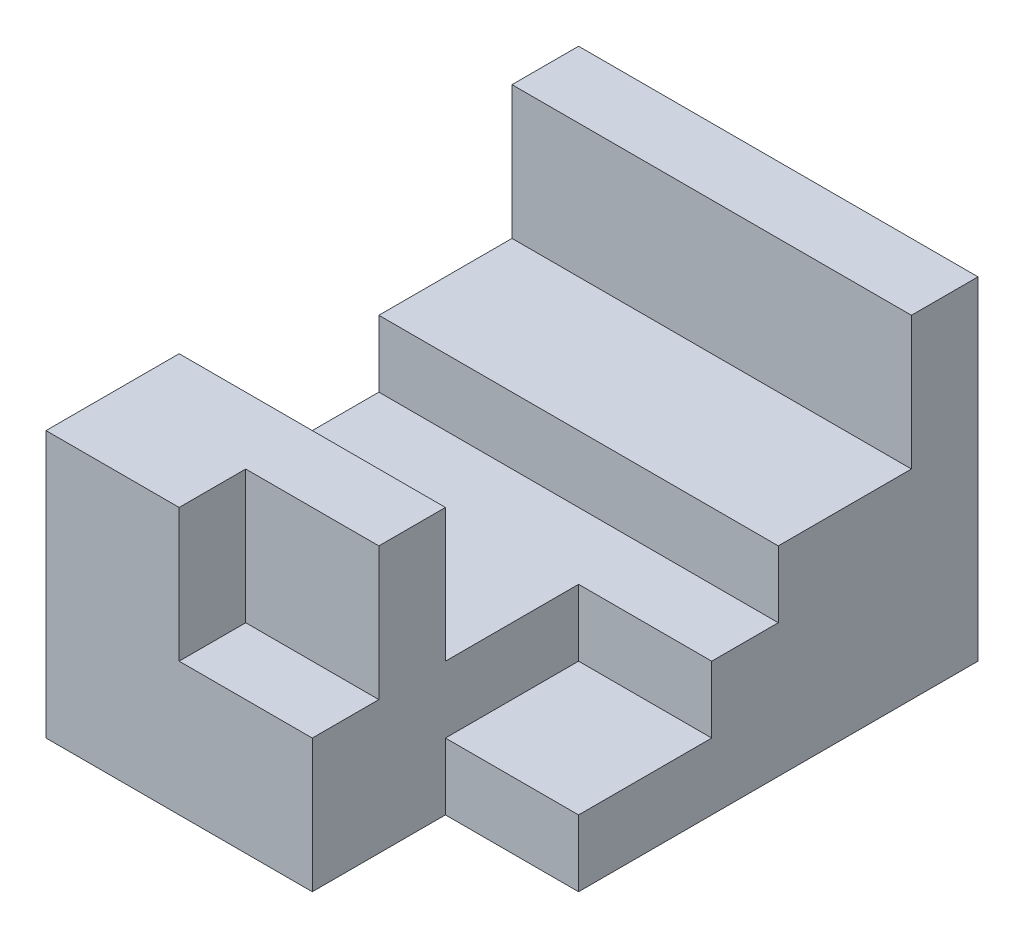
ISO-10303-21;
HEADER;
FILE_DESCRIPTION(('STEP AP214'),'2;1');
FILE_NAME('part.step','',(''),(''),'','','');
FILE_SCHEMA(('AUTOMOTIVE_DESIGN { 1 0 10303 214 1 1 1 1 }'));
ENDSEC;
DATA;
#1=APPLICATION_CONTEXT('core data for automotive mechanical design processes');
#2=APPLICATION_PROTOCOL_DEFINITION('international standard','automotive_design',2000,#1);
#3=PRODUCT_CONTEXT('',#1,'mechanical');
#4=PRODUCT('Part','Part','',(#3));
#5=PRODUCT_RELATED_PRODUCT_CATEGORY('part','',(#4));
#6=PRODUCT_DEFINITION_FORMATION('','',#4);
#7=PRODUCT_DEFINITION_CONTEXT('part definition',#1,'design');
#8=PRODUCT_DEFINITION('design','',#6,#7);
#9=PRODUCT_DEFINITION_SHAPE('','',#8);
#10=(LENGTH_UNIT() NAMED_UNIT(*) SI_UNIT(.MILLI.,.METRE.));
#11=(NAMED_UNIT(*) PLANE_ANGLE_UNIT() SI_UNIT($,.RADIAN.));
#12=(NAMED_UNIT(*) SI_UNIT($,.STERADIAN.) SOLID_ANGLE_UNIT());
#13=UNCERTAINTY_MEASURE_WITH_UNIT(LENGTH_MEASURE(1.E-05),#10,'distance_accuracy_value','');
#14=(GEOMETRIC_REPRESENTATION_CONTEXT(3) GLOBAL_UNCERTAINTY_ASSIGNED_CONTEXT((#13)) GLOBAL_UNIT_ASSIGNED_CONTEXT((#10,
#11,#12)) REPRESENTATION_CONTEXT('',''));
#15=CARTESIAN_POINT('',(0.,0.,0.));
#16=DIRECTION('',(0.,0.,1.));
#17=DIRECTION('',(1.,0.,0.));
#18=AXIS2_PLACEMENT_3D('',#15,#16,#17);
#19=CARTESIAN_POINT('',(-3.,-2.5,8.));
#20=DIRECTION('',(1.,0.,0.));
#21=DIRECTION('',(0.,0.,-1.));
#22=AXIS2_PLACEMENT_3D('',#19,#20,#21);
#23=PLANE('',#22);
#24=DIRECTION('',(0.,0.,1.));
#25=VECTOR('',#24,1.);
#26=CARTESIAN_POINT('',(-3.,1.5,8.));
#27=LINE('',#26,#25);
#28=CARTESIAN_POINT('',(-3.,1.5,6.));
#29=VERTEX_POINT('',#28);
#30=CARTESIAN_POINT('',(-3.,1.5,8.));
#31=VERTEX_POINT('',#30);
#32=EDGE_CURVE('E183',#29,#31,#27,.T.);
#33=ORIENTED_EDGE('',*,*,#32,.F.);
#34=DIRECTION('',(0.,1.,0.));
#35=VECTOR('',#34,1.);
#36=CARTESIAN_POINT('',(-3.,0.499999999999999,6.));
#37=LINE('',#36,#35);
#38=CARTESIAN_POINT('',(-3.,-0.500000000000001,6.));
#39=VERTEX_POINT('',#38);
#40=EDGE_CURVE('E163',#39,#29,#37,.T.);
#41=ORIENTED_EDGE('',*,*,#40,.F.);
#42=DIRECTION('',(0.,0.,1.));
#43=VECTOR('',#42,1.);
#44=CARTESIAN_POINT('',(-3.,-0.500000000000001,3.));
#45=LINE('',#44,#43);
#46=CARTESIAN_POINT('',(-3.,-0.500000000000001,3.));
#47=VERTEX_POINT('',#46);
#48=EDGE_CURVE('E200',#47,#39,#45,.T.);
#49=ORIENTED_EDGE('',*,*,#48,.F.);
#50=DIRECTION('',(0.,1.,0.));
#51=VECTOR('',#50,1.);
#52=CARTESIAN_POINT('',(-3.,-0.500000000000001,3.));
#53=LINE('',#52,#51);
#54=CARTESIAN_POINT('',(-3.,0.499999999999999,3.));
#55=VERTEX_POINT('',#54);
#56=EDGE_CURVE('E208',#47,#55,#53,.T.);
#57=ORIENTED_EDGE('',*,*,#56,.T.);
#58=DIRECTION('',(0.,0.,1.));
#59=VECTOR('',#58,1.);
#60=CARTESIAN_POINT('',(-3.,0.499999999999999,1.));
#61=LINE('',#60,#59);
#62=CARTESIAN_POINT('',(-3.,0.499999999999999,1.));
#63=VERTEX_POINT('',#62);
#64=EDGE_CURVE('E234',#63,#55,#61,.T.);
#65=ORIENTED_EDGE('',*,*,#64,.F.);
#66=DIRECTION('',(0.,1.,0.));
#67=VECTOR('',#66,1.);
#68=CARTESIAN_POINT('',(-3.,0.499999999999999,1.));
#69=LINE('',#68,#67);
#70=CARTESIAN_POINT('',(-3.,2.5,1.));
#71=VERTEX_POINT('',#70);
#72=EDGE_CURVE('E241',#63,#71,#69,.T.);
#73=ORIENTED_EDGE('',*,*,#72,.T.);
#74=DIRECTION('',(0.,0.,-1.));
#75=VECTOR('',#74,1.);
#76=CARTESIAN_POINT('',(-3.,2.5,8.));
#77=LINE('',#76,#75);
#78=CARTESIAN_POINT('',(-3.,2.5,0.));
#79=VERTEX_POINT('',#78);
#80=EDGE_CURVE('E267',#71,#79,#77,.T.);
#81=ORIENTED_EDGE('',*,*,#80,.T.);
#82=DIRECTION('',(0.,-1.,0.));
#83=VECTOR('',#82,1.);
#84=CARTESIAN_POINT('',(-3.,-2.5,0.));
#85=LINE('',#84,#83);
#86=CARTESIAN_POINT('',(-3.,-2.5,0.));
#87=VERTEX_POINT('',#86);
#88=EDGE_CURVE('E261',#79,#87,#85,.T.);
#89=ORIENTED_EDGE('',*,*,#88,.T.);
#90=DIRECTION('',(0.,0.,-1.));
#91=VECTOR('',#90,1.);
#92=CARTESIAN_POINT('',(-3.,-2.5,8.));
#93=LINE('',#92,#91);
#94=CARTESIAN_POINT('',(-3.,-2.5,8.));
#95=VERTEX_POINT('',#94);
#96=EDGE_CURVE('E40',#95,#87,#93,.T.);
#97=ORIENTED_EDGE('',*,*,#96,.F.);
#98=DIRECTION('',(0.,-1.,0.));
#99=VECTOR('',#98,1.);
#100=CARTESIAN_POINT('',(-3.,-2.5,8.));
#101=LINE('',#100,#99);
#102=EDGE_CURVE('E262',#31,#95,#101,.T.);
#103=ORIENTED_EDGE('',*,*,#102,.F.);
#104=EDGE_LOOP('',(#33,#41,#49,#57,#65,#73,#81,#89,#97,#103));
#105=FACE_BOUND('',#104,.T.);
#106=ADVANCED_FACE('F33',(#105),#23,.F.);
#107=CARTESIAN_POINT('',(0.,0.,8.));
#108=DIRECTION('',(0.,0.,1.));
#109=DIRECTION('',(1.,0.,0.));
#110=AXIS2_PLACEMENT_3D('',#107,#108,#109);
#111=PLANE('',#110);
#112=DIRECTION('',(1.,0.,0.));
#113=VECTOR('',#112,1.);
#114=CARTESIAN_POINT('',(-1.,-0.500000000000001,8.));
#115=LINE('',#114,#113);
#116=CARTESIAN_POINT('',(-1.,-0.500000000000001,8.));
#117=VERTEX_POINT('',#116);
#118=CARTESIAN_POINT('',(1.,-0.500000000000001,8.));
#119=VERTEX_POINT('',#118);
#120=EDGE_CURVE('E168',#117,#119,#115,.T.);
#121=ORIENTED_EDGE('',*,*,#120,.F.);
#122=DIRECTION('',(0.,-1.,0.));
#123=VECTOR('',#122,1.);
#124=CARTESIAN_POINT('',(-1.,2.5,8.));
#125=LINE('',#124,#123);
#126=CARTESIAN_POINT('',(-1.,1.5,8.));
#127=VERTEX_POINT('',#126);
#128=EDGE_CURVE('E152',#127,#117,#125,.T.);
#129=ORIENTED_EDGE('',*,*,#128,.F.);
#130=DIRECTION('',(-1.,0.,0.));
#131=VECTOR('',#130,1.);
#132=CARTESIAN_POINT('',(0.,1.5,8.));
#133=LINE('',#132,#131);
#134=EDGE_CURVE('E189',#127,#31,#133,.T.);
#135=ORIENTED_EDGE('',*,*,#134,.T.);
#136=ORIENTED_EDGE('',*,*,#102,.T.);
#137=DIRECTION('',(1.,0.,0.));
#138=VECTOR('',#137,1.);
#139=CARTESIAN_POINT('',(3.,-2.5,8.));
#140=LINE('',#139,#138);
#141=CARTESIAN_POINT('',(1.,-2.5,8.));
#142=VERTEX_POINT('',#141);
#143=EDGE_CURVE('E264',#95,#142,#140,.T.);
#144=ORIENTED_EDGE('',*,*,#143,.T.);
#145=DIRECTION('',(0.,-1.,0.));
#146=VECTOR('',#145,1.);
#147=CARTESIAN_POINT('',(1.,-2.5,8.));
#148=LINE('',#147,#146);
#149=EDGE_CURVE('E176',#119,#142,#148,.T.);
#150=ORIENTED_EDGE('',*,*,#149,.F.);
#151=EDGE_LOOP('',(#121,#129,#135,#136,#144,#150));
#152=FACE_BOUND('',#151,.T.);
#153=ADVANCED_FACE('F174',(#152),#111,.T.);
#154=CARTESIAN_POINT('',(1.,-2.5,6.));
#155=DIRECTION('',(-1.,0.,0.));
#156=DIRECTION('',(0.,0.,1.));
#157=AXIS2_PLACEMENT_3D('',#154,#155,#156);
#158=PLANE('',#157);
#159=DIRECTION('',(0.,1.,0.));
#160=VECTOR('',#159,1.);
#161=CARTESIAN_POINT('',(1.,2.5,7.));
#162=LINE('',#161,#160);
#163=CARTESIAN_POINT('',(1.,-0.500000000000001,7.));
#164=VERTEX_POINT('',#163);
#165=CARTESIAN_POINT('',(1.,1.5,7.));
#166=VERTEX_POINT('',#165);
#167=EDGE_CURVE('E162',#164,#166,#162,.T.);
#168=ORIENTED_EDGE('',*,*,#167,.F.);
#169=DIRECTION('',(0.,0.,-1.));
#170=VECTOR('',#169,1.);
#171=CARTESIAN_POINT('',(1.,-0.500000000000001,7.));
#172=LINE('',#171,#170);
#173=EDGE_CURVE('E177',#119,#164,#172,.T.);
#174=ORIENTED_EDGE('',*,*,#173,.F.);
#175=ORIENTED_EDGE('',*,*,#149,.T.);
#176=DIRECTION('',(0.,0.,1.));
#177=VECTOR('',#176,1.);
#178=CARTESIAN_POINT('',(1.,-2.5,6.));
#179=LINE('',#178,#177);
#180=CARTESIAN_POINT('',(1.,-2.5,6.));
#181=VERTEX_POINT('',#180);
#182=EDGE_CURVE('E257',#181,#142,#179,.T.);
#183=ORIENTED_EDGE('',*,*,#182,.F.);
#184=DIRECTION('',(0.,-1.,0.));
#185=VECTOR('',#184,1.);
#186=CARTESIAN_POINT('',(1.,-2.5,6.));
#187=LINE('',#186,#185);
#188=CARTESIAN_POINT('',(1.,-1.5,6.));
#189=VERTEX_POINT('',#188);
#190=EDGE_CURVE('E252',#189,#181,#187,.T.);
#191=ORIENTED_EDGE('',*,*,#190,.F.);
#192=DIRECTION('',(0.,0.,1.));
#193=VECTOR('',#192,1.);
#194=CARTESIAN_POINT('',(1.,-1.5,4.));
#195=LINE('',#194,#193);
#196=CARTESIAN_POINT('',(1.,-1.5,4.));
#197=VERTEX_POINT('',#196);
#198=EDGE_CURVE('E220',#197,#189,#195,.T.);
#199=ORIENTED_EDGE('',*,*,#198,.F.);
#200=DIRECTION('',(0.,1.,0.));
#201=VECTOR('',#200,1.);
#202=CARTESIAN_POINT('',(1.,-1.5,4.));
#203=LINE('',#202,#201);
#204=CARTESIAN_POINT('',(1.,-0.5,4.));
#205=VERTEX_POINT('',#204);
#206=EDGE_CURVE('E223',#197,#205,#203,.T.);
#207=ORIENTED_EDGE('',*,*,#206,.T.);
#208=DIRECTION('',(0.,0.,-1.));
#209=VECTOR('',#208,1.);
#210=CARTESIAN_POINT('',(1.,-0.5,6.));
#211=LINE('',#210,#209);
#212=CARTESIAN_POINT('',(1.,-0.5,6.));
#213=VERTEX_POINT('',#212);
#214=EDGE_CURVE('E54',#213,#205,#211,.T.);
#215=ORIENTED_EDGE('',*,*,#214,.F.);
#216=CARTESIAN_POINT('',(1.,1.5,6.));
#217=VERTEX_POINT('',#216);
#218=EDGE_CURVE('E253',#217,#213,#187,.T.);
#219=ORIENTED_EDGE('',*,*,#218,.F.);
#220=DIRECTION('',(0.,0.,-1.));
#221=VECTOR('',#220,1.);
#222=CARTESIAN_POINT('',(1.,1.5,6.));
#223=LINE('',#222,#221);
#224=EDGE_CURVE('E46',#166,#217,#223,.T.);
#225=ORIENTED_EDGE('',*,*,#224,.F.);
#226=EDGE_LOOP('',(#168,#174,#175,#183,#191,#199,#207,#215,#219,#225));
#227=FACE_BOUND('',#226,.T.);
#228=ADVANCED_FACE('F312',(#227),#158,.F.);
#229=CARTESIAN_POINT('',(-1.,2.5,7.));
#230=DIRECTION('',(-1.,0.,0.));
#231=DIRECTION('',(0.,-1.,0.));
#232=AXIS2_PLACEMENT_3D('',#229,#230,#231);
#233=PLANE('',#232);
#234=DIRECTION('',(0.,0.,-1.));
#235=VECTOR('',#234,1.);
#236=CARTESIAN_POINT('',(-1.,1.5,7.));
#237=LINE('',#236,#235);
#238=CARTESIAN_POINT('',(-1.,1.5,7.));
#239=VERTEX_POINT('',#238);
#240=EDGE_CURVE('E158',#127,#239,#237,.T.);
#241=ORIENTED_EDGE('',*,*,#240,.F.);
#242=ORIENTED_EDGE('',*,*,#128,.T.);
#243=DIRECTION('',(0.,0.,1.));
#244=VECTOR('',#243,1.);
#245=CARTESIAN_POINT('',(-1.,-0.500000000000001,7.));
#246=LINE('',#245,#244);
#247=CARTESIAN_POINT('',(-1.,-0.500000000000001,7.));
#248=VERTEX_POINT('',#247);
#249=EDGE_CURVE('E156',#248,#117,#246,.T.);
#250=ORIENTED_EDGE('',*,*,#249,.F.);
#251=DIRECTION('',(0.,-1.,0.));
#252=VECTOR('',#251,1.);
#253=CARTESIAN_POINT('',(-1.,2.5,7.));
#254=LINE('',#253,#252);
#255=EDGE_CURVE('E247',#239,#248,#254,.T.);
#256=ORIENTED_EDGE('',*,*,#255,.F.);
#257=EDGE_LOOP('',(#241,#242,#250,#256));
#258=FACE_BOUND('',#257,.T.);
#259=ADVANCED_FACE('F154',(#258),#233,.F.);
#260=CARTESIAN_POINT('',(0.,0.,7.));
#261=DIRECTION('',(0.,0.,1.));
#262=DIRECTION('',(1.,0.,0.));
#263=AXIS2_PLACEMENT_3D('',#260,#261,#262);
#264=PLANE('',#263);
#265=ORIENTED_EDGE('',*,*,#167,.T.);
#266=DIRECTION('',(-1.,0.,0.));
#267=VECTOR('',#266,1.);
#268=CARTESIAN_POINT('',(0.,1.5,7.));
#269=LINE('',#268,#267);
#270=EDGE_CURVE('E185',#166,#239,#269,.T.);
#271=ORIENTED_EDGE('',*,*,#270,.T.);
#272=ORIENTED_EDGE('',*,*,#255,.T.);
#273=DIRECTION('',(-1.,0.,0.));
#274=VECTOR('',#273,1.);
#275=CARTESIAN_POINT('',(-1.,-0.500000000000001,7.));
#276=LINE('',#275,#274);
#277=EDGE_CURVE('E171',#164,#248,#276,.T.);
#278=ORIENTED_EDGE('',*,*,#277,.F.);
#279=EDGE_LOOP('',(#265,#271,#272,#278));
#280=FACE_BOUND('',#279,.T.);
#281=ADVANCED_FACE('F314',(#280),#264,.T.);
#282=CARTESIAN_POINT('',(-3.,0.499999999999999,6.));
#283=DIRECTION('',(0.,0.,1.));
#284=DIRECTION('',(1.,0.,0.));
#285=AXIS2_PLACEMENT_3D('',#282,#283,#284);
#286=PLANE('',#285);
#287=DIRECTION('',(-1.,0.,0.));
#288=VECTOR('',#287,1.);
#289=CARTESIAN_POINT('',(-3.,1.5,6.));
#290=LINE('',#289,#288);
#291=EDGE_CURVE('E11',#217,#29,#290,.T.);
#292=ORIENTED_EDGE('',*,*,#291,.F.);
#293=ORIENTED_EDGE('',*,*,#218,.T.);
#294=DIRECTION('',(1.,0.,0.));
#295=VECTOR('',#294,1.);
#296=CARTESIAN_POINT('',(-3.,-0.500000000000001,6.));
#297=LINE('',#296,#295);
#298=EDGE_CURVE('E203',#39,#213,#297,.T.);
#299=ORIENTED_EDGE('',*,*,#298,.F.);
#300=ORIENTED_EDGE('',*,*,#40,.T.);
#301=EDGE_LOOP('',(#292,#293,#299,#300));
#302=FACE_BOUND('',#301,.T.);
#303=ADVANCED_FACE('F319',(#302),#286,.F.);
#304=CARTESIAN_POINT('',(3.,-1.5,4.));
#305=DIRECTION('',(0.,0.,-1.));
#306=DIRECTION('',(-1.,0.,0.));
#307=AXIS2_PLACEMENT_3D('',#304,#305,#306);
#308=PLANE('',#307);
#309=DIRECTION('',(1.,0.,0.));
#310=VECTOR('',#309,1.);
#311=CARTESIAN_POINT('',(1.,-0.5,4.));
#312=LINE('',#311,#310);
#313=CARTESIAN_POINT('',(3.,-0.5,4.));
#314=VERTEX_POINT('',#313);
#315=EDGE_CURVE('E192',#205,#314,#312,.T.);
#316=ORIENTED_EDGE('',*,*,#315,.F.);
#317=ORIENTED_EDGE('',*,*,#206,.F.);
#318=DIRECTION('',(-1.,0.,0.));
#319=VECTOR('',#318,1.);
#320=CARTESIAN_POINT('',(3.,-1.5,4.));
#321=LINE('',#320,#319);
#322=CARTESIAN_POINT('',(3.,-1.5,4.));
#323=VERTEX_POINT('',#322);
#324=EDGE_CURVE('E217',#323,#197,#321,.T.);
#325=ORIENTED_EDGE('',*,*,#324,.F.);
#326=DIRECTION('',(0.,1.,0.));
#327=VECTOR('',#326,1.);
#328=CARTESIAN_POINT('',(3.,-1.5,4.));
#329=LINE('',#328,#327);
#330=EDGE_CURVE('E222',#323,#314,#329,.T.);
#331=ORIENTED_EDGE('',*,*,#330,.T.);
#332=EDGE_LOOP('',(#316,#317,#325,#331));
#333=FACE_BOUND('',#332,.T.);
#334=ADVANCED_FACE('F336',(#333),#308,.F.);
#335=CARTESIAN_POINT('',(0.,0.,6.));
#336=DIRECTION('',(0.,0.,-1.));
#337=DIRECTION('',(-1.,0.,0.));
#338=AXIS2_PLACEMENT_3D('',#335,#336,#337);
#339=PLANE('',#338);
#340=DIRECTION('',(1.,0.,0.));
#341=VECTOR('',#340,1.);
#342=CARTESIAN_POINT('',(1.,-1.5,6.));
#343=LINE('',#342,#341);
#344=CARTESIAN_POINT('',(3.,-1.5,6.));
#345=VERTEX_POINT('',#344);
#346=EDGE_CURVE('E211',#189,#345,#343,.T.);
#347=ORIENTED_EDGE('',*,*,#346,.F.);
#348=ORIENTED_EDGE('',*,*,#190,.T.);
#349=DIRECTION('',(1.,0.,0.));
#350=VECTOR('',#349,1.);
#351=CARTESIAN_POINT('',(3.,-2.5,6.));
#352=LINE('',#351,#350);
#353=CARTESIAN_POINT('',(3.,-2.5,6.));
#354=VERTEX_POINT('',#353);
#355=EDGE_CURVE('E255',#181,#354,#352,.T.);
#356=ORIENTED_EDGE('',*,*,#355,.T.);
#357=DIRECTION('',(0.,1.,0.));
#358=VECTOR('',#357,1.);
#359=CARTESIAN_POINT('',(3.,2.5,6.));
#360=LINE('',#359,#358);
#361=EDGE_CURVE('E249',#354,#345,#360,.T.);
#362=ORIENTED_EDGE('',*,*,#361,.T.);
#363=EDGE_LOOP('',(#347,#348,#356,#362));
#364=FACE_BOUND('',#363,.T.);
#365=ADVANCED_FACE('F308',(#364),#339,.F.);
#366=CARTESIAN_POINT('',(3.,-2.5,8.));
#367=DIRECTION('',(0.,1.,0.));
#368=DIRECTION('',(-1.,0.,0.));
#369=AXIS2_PLACEMENT_3D('',#366,#367,#368);
#370=PLANE('',#369);
#371=ORIENTED_EDGE('',*,*,#355,.F.);
#372=ORIENTED_EDGE('',*,*,#182,.T.);
#373=ORIENTED_EDGE('',*,*,#143,.F.);
#374=ORIENTED_EDGE('',*,*,#96,.T.);
#375=DIRECTION('',(1.,0.,0.));
#376=VECTOR('',#375,1.);
#377=CARTESIAN_POINT('',(3.,-2.5,0.));
#378=LINE('',#377,#376);
#379=CARTESIAN_POINT('',(3.,-2.5,0.));
#380=VERTEX_POINT('',#379);
#381=EDGE_CURVE('E270',#87,#380,#378,.T.);
#382=ORIENTED_EDGE('',*,*,#381,.T.);
#383=DIRECTION('',(0.,0.,-1.));
#384=VECTOR('',#383,1.);
#385=CARTESIAN_POINT('',(3.,-2.5,8.));
#386=LINE('',#385,#384);
#387=EDGE_CURVE('E281',#354,#380,#386,.T.);
#388=ORIENTED_EDGE('',*,*,#387,.F.);
#389=EDGE_LOOP('',(#371,#372,#373,#374,#382,#388));
#390=FACE_BOUND('',#389,.T.);
#391=ADVANCED_FACE('F287',(#390),#370,.F.);
#392=CARTESIAN_POINT('',(3.,-2.5,8.));
#393=DIRECTION('',(-1.,0.,0.));
#394=DIRECTION('',(0.,0.,1.));
#395=AXIS2_PLACEMENT_3D('',#392,#393,#394);
#396=PLANE('',#395);
#397=DIRECTION('',(0.,0.,-1.));
#398=VECTOR('',#397,1.);
#399=CARTESIAN_POINT('',(3.,0.5,6.));
#400=LINE('',#399,#398);
#401=CARTESIAN_POINT('',(3.,0.5,3.));
#402=VERTEX_POINT('',#401);
#403=CARTESIAN_POINT('',(3.,0.5,0.999999999999999));
#404=VERTEX_POINT('',#403);
#405=EDGE_CURVE('E229',#402,#404,#400,.T.);
#406=ORIENTED_EDGE('',*,*,#405,.F.);
#407=DIRECTION('',(0.,1.,0.));
#408=VECTOR('',#407,1.);
#409=CARTESIAN_POINT('',(3.,-0.5,3.));
#410=LINE('',#409,#408);
#411=CARTESIAN_POINT('',(3.,-0.5,3.));
#412=VERTEX_POINT('',#411);
#413=EDGE_CURVE('E206',#412,#402,#410,.T.);
#414=ORIENTED_EDGE('',*,*,#413,.F.);
#415=DIRECTION('',(0.,0.,-1.));
#416=VECTOR('',#415,1.);
#417=CARTESIAN_POINT('',(3.,-0.5,4.));
#418=LINE('',#417,#416);
#419=EDGE_CURVE('E194',#314,#412,#418,.T.);
#420=ORIENTED_EDGE('',*,*,#419,.F.);
#421=ORIENTED_EDGE('',*,*,#330,.F.);
#422=DIRECTION('',(0.,0.,-1.));
#423=VECTOR('',#422,1.);
#424=CARTESIAN_POINT('',(3.,-1.5,6.));
#425=LINE('',#424,#423);
#426=EDGE_CURVE('E214',#345,#323,#425,.T.);
#427=ORIENTED_EDGE('',*,*,#426,.F.);
#428=ORIENTED_EDGE('',*,*,#361,.F.);
#429=ORIENTED_EDGE('',*,*,#387,.T.);
#430=DIRECTION('',(0.,1.,0.));
#431=VECTOR('',#430,1.);
#432=CARTESIAN_POINT('',(3.,-2.5,0.));
#433=LINE('',#432,#431);
#434=CARTESIAN_POINT('',(3.,2.5,0.));
#435=VERTEX_POINT('',#434);
#436=EDGE_CURVE('E273',#380,#435,#433,.T.);
#437=ORIENTED_EDGE('',*,*,#436,.T.);
#438=DIRECTION('',(0.,0.,-1.));
#439=VECTOR('',#438,1.);
#440=CARTESIAN_POINT('',(3.,2.5,8.));
#441=LINE('',#440,#439);
#442=CARTESIAN_POINT('',(3.,2.5,0.999999999999999));
#443=VERTEX_POINT('',#442);
#444=EDGE_CURVE('E279',#443,#435,#441,.T.);
#445=ORIENTED_EDGE('',*,*,#444,.F.);
#446=DIRECTION('',(0.,1.,0.));
#447=VECTOR('',#446,1.);
#448=CARTESIAN_POINT('',(3.,0.5,0.999999999999999));
#449=LINE('',#448,#447);
#450=EDGE_CURVE('E237',#404,#443,#449,.T.);
#451=ORIENTED_EDGE('',*,*,#450,.F.);
#452=EDGE_LOOP('',(#406,#414,#420,#421,#427,#428,#429,#437,#445,#451));
#453=FACE_BOUND('',#452,.T.);
#454=ADVANCED_FACE('F301',(#453),#396,.F.);
#455=CARTESIAN_POINT('',(3.,2.5,8.));
#456=DIRECTION('',(0.,-1.,0.));
#457=DIRECTION('',(1.,0.,0.));
#458=AXIS2_PLACEMENT_3D('',#455,#456,#457);
#459=PLANE('',#458);
#460=ORIENTED_EDGE('',*,*,#80,.F.);
#461=DIRECTION('',(-1.,0.,0.));
#462=VECTOR('',#461,1.);
#463=CARTESIAN_POINT('',(3.,2.5,0.999999999999999));
#464=LINE('',#463,#462);
#465=EDGE_CURVE('E226',#443,#71,#464,.T.);
#466=ORIENTED_EDGE('',*,*,#465,.F.);
#467=ORIENTED_EDGE('',*,*,#444,.T.);
#468=DIRECTION('',(-1.,0.,0.));
#469=VECTOR('',#468,1.);
#470=CARTESIAN_POINT('',(3.,2.5,0.));
#471=LINE('',#470,#469);
#472=EDGE_CURVE('E265',#435,#79,#471,.T.);
#473=ORIENTED_EDGE('',*,*,#472,.T.);
#474=EDGE_LOOP('',(#460,#466,#467,#473));
#475=FACE_BOUND('',#474,.T.);
#476=ADVANCED_FACE('F364',(#475),#459,.F.);
#477=CARTESIAN_POINT('',(0.,0.,0.));
#478=DIRECTION('',(0.,0.,1.));
#479=DIRECTION('',(1.,0.,0.));
#480=AXIS2_PLACEMENT_3D('',#477,#478,#479);
#481=PLANE('',#480);
#482=ORIENTED_EDGE('',*,*,#88,.F.);
#483=ORIENTED_EDGE('',*,*,#472,.F.);
#484=ORIENTED_EDGE('',*,*,#436,.F.);
#485=ORIENTED_EDGE('',*,*,#381,.F.);
#486=EDGE_LOOP('',(#482,#483,#484,#485));
#487=FACE_BOUND('',#486,.T.);
#488=ADVANCED_FACE('F297',(#487),#481,.F.);
#489=CARTESIAN_POINT('',(3.,0.5,0.999999999999999));
#490=DIRECTION('',(0.,0.,-1.));
#491=DIRECTION('',(-1.,0.,0.));
#492=AXIS2_PLACEMENT_3D('',#489,#490,#491);
#493=PLANE('',#492);
#494=ORIENTED_EDGE('',*,*,#465,.T.);
#495=ORIENTED_EDGE('',*,*,#72,.F.);
#496=DIRECTION('',(-1.,0.,0.));
#497=VECTOR('',#496,1.);
#498=CARTESIAN_POINT('',(3.,0.5,0.999999999999999));
#499=LINE('',#498,#497);
#500=EDGE_CURVE('E231',#404,#63,#499,.T.);
#501=ORIENTED_EDGE('',*,*,#500,.F.);
#502=ORIENTED_EDGE('',*,*,#450,.T.);
#503=EDGE_LOOP('',(#494,#495,#501,#502));
#504=FACE_BOUND('',#503,.T.);
#505=ADVANCED_FACE('F329',(#504),#493,.F.);
#506=CARTESIAN_POINT('',(0.,0.5,0.));
#507=DIRECTION('',(0.,1.,0.));
#508=DIRECTION('',(-1.,0.,0.));
#509=AXIS2_PLACEMENT_3D('',#506,#507,#508);
#510=PLANE('',#509);
#511=DIRECTION('',(-1.,0.,0.));
#512=VECTOR('',#511,1.);
#513=CARTESIAN_POINT('',(3.,0.5,3.));
#514=LINE('',#513,#512);
#515=EDGE_CURVE('E191',#402,#55,#514,.T.);
#516=ORIENTED_EDGE('',*,*,#515,.F.);
#517=ORIENTED_EDGE('',*,*,#405,.T.);
#518=ORIENTED_EDGE('',*,*,#500,.T.);
#519=ORIENTED_EDGE('',*,*,#64,.T.);
#520=EDGE_LOOP('',(#516,#517,#518,#519));
#521=FACE_BOUND('',#520,.T.);
#522=ADVANCED_FACE('F326',(#521),#510,.T.);
#523=CARTESIAN_POINT('',(0.,-1.5,0.));
#524=DIRECTION('',(0.,1.,0.));
#525=DIRECTION('',(-1.,0.,0.));
#526=AXIS2_PLACEMENT_3D('',#523,#524,#525);
#527=PLANE('',#526);
#528=ORIENTED_EDGE('',*,*,#346,.T.);
#529=ORIENTED_EDGE('',*,*,#426,.T.);
#530=ORIENTED_EDGE('',*,*,#324,.T.);
#531=ORIENTED_EDGE('',*,*,#198,.T.);
#532=EDGE_LOOP('',(#528,#529,#530,#531));
#533=FACE_BOUND('',#532,.T.);
#534=ADVANCED_FACE('F338',(#533),#527,.T.);
#535=CARTESIAN_POINT('',(3.,-0.5,3.));
#536=DIRECTION('',(0.,0.,-1.));
#537=DIRECTION('',(-1.,0.,0.));
#538=AXIS2_PLACEMENT_3D('',#535,#536,#537);
#539=PLANE('',#538);
#540=ORIENTED_EDGE('',*,*,#515,.T.);
#541=ORIENTED_EDGE('',*,*,#56,.F.);
#542=DIRECTION('',(-1.,0.,0.));
#543=VECTOR('',#542,1.);
#544=CARTESIAN_POINT('',(3.,-0.5,3.));
#545=LINE('',#544,#543);
#546=EDGE_CURVE('E197',#412,#47,#545,.T.);
#547=ORIENTED_EDGE('',*,*,#546,.F.);
#548=ORIENTED_EDGE('',*,*,#413,.T.);
#549=EDGE_LOOP('',(#540,#541,#547,#548));
#550=FACE_BOUND('',#549,.T.);
#551=ADVANCED_FACE('F334',(#550),#539,.F.);
#552=CARTESIAN_POINT('',(0.,-0.500000000000001,0.));
#553=DIRECTION('',(0.,1.,0.));
#554=DIRECTION('',(-1.,0.,0.));
#555=AXIS2_PLACEMENT_3D('',#552,#553,#554);
#556=PLANE('',#555);
#557=ORIENTED_EDGE('',*,*,#315,.T.);
#558=ORIENTED_EDGE('',*,*,#419,.T.);
#559=ORIENTED_EDGE('',*,*,#546,.T.);
#560=ORIENTED_EDGE('',*,*,#48,.T.);
#561=ORIENTED_EDGE('',*,*,#298,.T.);
#562=ORIENTED_EDGE('',*,*,#214,.T.);
#563=EDGE_LOOP('',(#557,#558,#559,#560,#561,#562));
#564=FACE_BOUND('',#563,.T.);
#565=ADVANCED_FACE('F320',(#564),#556,.T.);
#566=CARTESIAN_POINT('',(0.,1.5,0.));
#567=DIRECTION('',(0.,1.,0.));
#568=DIRECTION('',(-1.,0.,0.));
#569=AXIS2_PLACEMENT_3D('',#566,#567,#568);
#570=PLANE('',#569);
#571=ORIENTED_EDGE('',*,*,#240,.T.);
#572=ORIENTED_EDGE('',*,*,#270,.F.);
#573=ORIENTED_EDGE('',*,*,#224,.T.);
#574=ORIENTED_EDGE('',*,*,#291,.T.);
#575=ORIENTED_EDGE('',*,*,#32,.T.);
#576=ORIENTED_EDGE('',*,*,#134,.F.);
#577=EDGE_LOOP('',(#571,#572,#573,#574,#575,#576));
#578=FACE_BOUND('',#577,.T.);
#579=ADVANCED_FACE('F315',(#578),#570,.T.);
#580=CARTESIAN_POINT('',(0.,-0.500000000000001,0.));
#581=DIRECTION('',(0.,1.,0.));
#582=DIRECTION('',(0.,0.,1.));
#583=AXIS2_PLACEMENT_3D('',#580,#581,#582);
#584=PLANE('',#583);
#585=ORIENTED_EDGE('',*,*,#249,.T.);
#586=ORIENTED_EDGE('',*,*,#120,.T.);
#587=ORIENTED_EDGE('',*,*,#173,.T.);
#588=ORIENTED_EDGE('',*,*,#277,.T.);
#589=EDGE_LOOP('',(#585,#586,#587,#588));
#590=FACE_BOUND('',#589,.T.);
#591=ADVANCED_FACE('F166',(#590),#584,.T.);
#592=CLOSED_SHELL('',(#106,#153,#228,#259,#281,#303,#334,#365,#391,#454,#476,#488,#505,#522,
#534,#551,#565,#579,#591));
#593=MANIFOLD_SOLID_BREP('B2',#592);
#594=ADVANCED_BREP_SHAPE_REPRESENTATION('',(#18,#593),#14);
#595=SHAPE_DEFINITION_REPRESENTATION(#9,#594);
ENDSEC;
END-ISO-10303-21;
